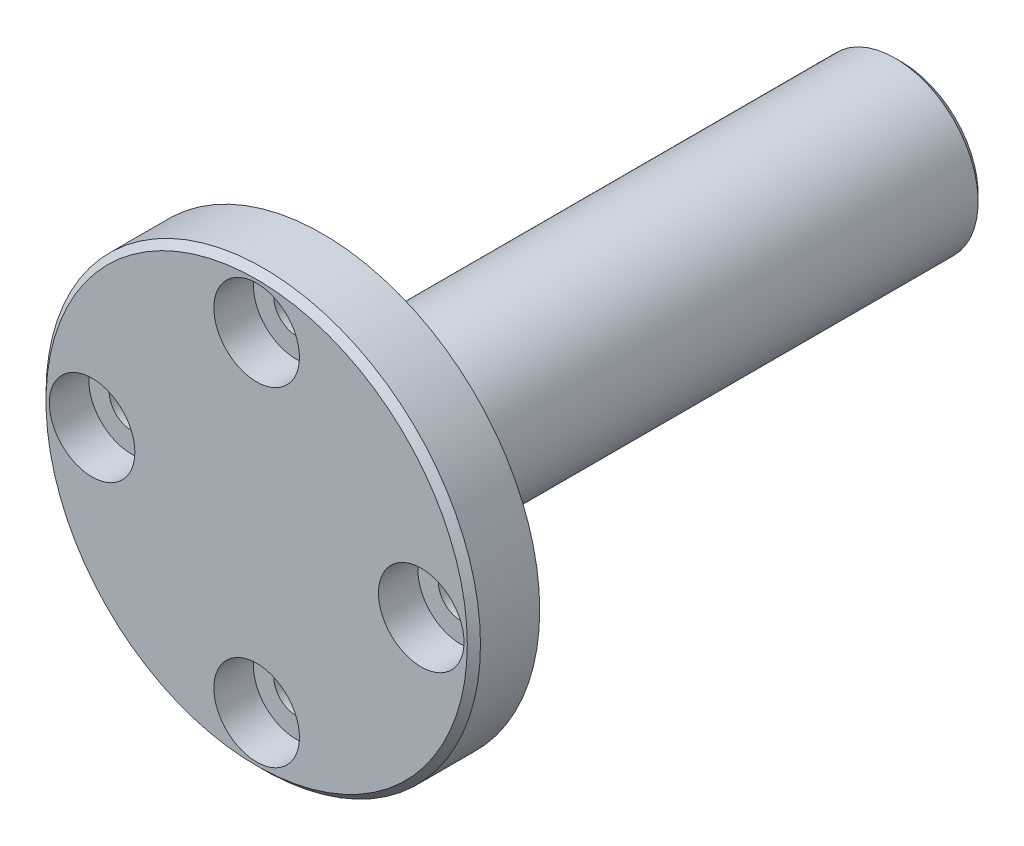
ISO-10303-21;
HEADER;
FILE_DESCRIPTION(('STEP AP214'),'2;1');
FILE_NAME('part.step','',(''),(''),'','','');
FILE_SCHEMA(('AUTOMOTIVE_DESIGN { 1 0 10303 214 1 1 1 1 }'));
ENDSEC;
DATA;
#1=APPLICATION_CONTEXT('core data for automotive mechanical design processes');
#2=APPLICATION_PROTOCOL_DEFINITION('international standard','automotive_design',2000,#1);
#3=PRODUCT_CONTEXT('',#1,'mechanical');
#4=PRODUCT('Part','Part','',(#3));
#5=PRODUCT_RELATED_PRODUCT_CATEGORY('part','',(#4));
#6=PRODUCT_DEFINITION_FORMATION('','',#4);
#7=PRODUCT_DEFINITION_CONTEXT('part definition',#1,'design');
#8=PRODUCT_DEFINITION('design','',#6,#7);
#9=PRODUCT_DEFINITION_SHAPE('','',#8);
#10=(LENGTH_UNIT() NAMED_UNIT(*) SI_UNIT(.MILLI.,.METRE.));
#11=(NAMED_UNIT(*) PLANE_ANGLE_UNIT() SI_UNIT($,.RADIAN.));
#12=(NAMED_UNIT(*) SI_UNIT($,.STERADIAN.) SOLID_ANGLE_UNIT());
#13=UNCERTAINTY_MEASURE_WITH_UNIT(LENGTH_MEASURE(1.E-05),#10,'distance_accuracy_value','');
#14=(GEOMETRIC_REPRESENTATION_CONTEXT(3) GLOBAL_UNCERTAINTY_ASSIGNED_CONTEXT((#13)) GLOBAL_UNIT_ASSIGNED_CONTEXT((#10,
#11,#12)) REPRESENTATION_CONTEXT('',''));
#15=CARTESIAN_POINT('',(0.,0.,0.));
#16=DIRECTION('',(0.,0.,1.));
#17=DIRECTION('',(1.,0.,0.));
#18=AXIS2_PLACEMENT_3D('',#15,#16,#17);
#19=CARTESIAN_POINT('',(0.,0.,0.));
#20=DIRECTION('',(0.,0.,1.));
#21=DIRECTION('',(1.,0.,0.));
#22=AXIS2_PLACEMENT_3D('',#19,#20,#21);
#23=PLANE('',#22);
#24=CARTESIAN_POINT('',(0.,0.,0.));
#25=DIRECTION('',(0.,0.,1.));
#26=DIRECTION('',(1.,0.,0.));
#27=AXIS2_PLACEMENT_3D('',#24,#25,#26);
#28=CIRCLE('',#27,16.);
#29=CARTESIAN_POINT('',(16.,0.,0.));
#30=VERTEX_POINT('',#29);
#31=EDGE_CURVE('E13',#30,#30,#28,.T.);
#32=ORIENTED_EDGE('',*,*,#31,.T.);
#33=EDGE_LOOP('',(#32));
#34=FACE_BOUND('',#33,.T.);
#35=CARTESIAN_POINT('',(-12.4999999999996,-3.52209826717166E-13,0.));
#36=DIRECTION('',(0.,0.,1.));
#37=DIRECTION('',(1.,0.,0.));
#38=AXIS2_PLACEMENT_3D('',#35,#36,#37);
#39=CIRCLE('',#38,3.25);
#40=CARTESIAN_POINT('',(-9.24999999999965,-3.52209826717166E-13,0.));
#41=VERTEX_POINT('',#40);
#42=EDGE_CURVE('E72',#41,#41,#39,.T.);
#43=ORIENTED_EDGE('',*,*,#42,.F.);
#44=EDGE_LOOP('',(#43));
#45=FACE_BOUND('',#44,.T.);
#46=CARTESIAN_POINT('',(0.,12.5,0.));
#47=DIRECTION('',(0.,0.,1.));
#48=DIRECTION('',(1.,0.,0.));
#49=AXIS2_PLACEMENT_3D('',#46,#47,#48);
#50=CIRCLE('',#49,3.25);
#51=CARTESIAN_POINT('',(3.25,12.5,0.));
#52=VERTEX_POINT('',#51);
#53=EDGE_CURVE('E87',#52,#52,#50,.T.);
#54=ORIENTED_EDGE('',*,*,#53,.F.);
#55=EDGE_LOOP('',(#54));
#56=FACE_BOUND('',#55,.T.);
#57=CARTESIAN_POINT('',(12.5000000000004,3.537406352161E-13,0.));
#58=DIRECTION('',(0.,0.,1.));
#59=DIRECTION('',(1.,0.,0.));
#60=AXIS2_PLACEMENT_3D('',#57,#58,#59);
#61=CIRCLE('',#60,3.25);
#62=CARTESIAN_POINT('',(15.7500000000004,3.537406352161E-13,0.));
#63=VERTEX_POINT('',#62);
#64=EDGE_CURVE('E97',#63,#63,#61,.T.);
#65=ORIENTED_EDGE('',*,*,#64,.F.);
#66=EDGE_LOOP('',(#65));
#67=FACE_BOUND('',#66,.T.);
#68=CARTESIAN_POINT('',(7.074812704322E-13,-12.5,0.));
#69=DIRECTION('',(0.,0.,1.));
#70=DIRECTION('',(1.,0.,0.));
#71=AXIS2_PLACEMENT_3D('',#68,#69,#70);
#72=CIRCLE('',#71,3.25);
#73=CARTESIAN_POINT('',(3.25000000000071,-12.5,0.));
#74=VERTEX_POINT('',#73);
#75=EDGE_CURVE('E107',#74,#74,#72,.T.);
#76=ORIENTED_EDGE('',*,*,#75,.F.);
#77=EDGE_LOOP('',(#76));
#78=FACE_BOUND('',#77,.T.);
#79=ADVANCED_FACE('F52',(#34,#45,#56,#67,#78),#23,.T.);
#80=CARTESIAN_POINT('',(0.,0.,-49.));
#81=DIRECTION('',(0.,0.,-1.));
#82=DIRECTION('',(-1.,0.,0.));
#83=AXIS2_PLACEMENT_3D('',#80,#81,#82);
#84=CYLINDRICAL_SURFACE('',#83,16.5);
#85=CARTESIAN_POINT('',(0.,0.,-0.500000000000007));
#86=DIRECTION('',(0.,0.,1.));
#87=DIRECTION('',(1.,0.,0.));
#88=AXIS2_PLACEMENT_3D('',#85,#86,#87);
#89=CIRCLE('',#88,16.5);
#90=CARTESIAN_POINT('',(16.5,0.,-0.500000000000007));
#91=VERTEX_POINT('',#90);
#92=EDGE_CURVE('E59',#91,#91,#89,.F.);
#93=ORIENTED_EDGE('',*,*,#92,.T.);
#94=EDGE_LOOP('',(#93));
#95=FACE_BOUND('',#94,.T.);
#96=CARTESIAN_POINT('',(0.,0.,-5.));
#97=DIRECTION('',(0.,0.,-1.));
#98=DIRECTION('',(-1.,0.,0.));
#99=AXIS2_PLACEMENT_3D('',#96,#97,#98);
#100=CIRCLE('',#99,16.5);
#101=CARTESIAN_POINT('',(-16.5,0.,-5.));
#102=VERTEX_POINT('',#101);
#103=EDGE_CURVE('E120',#102,#102,#100,.T.);
#104=ORIENTED_EDGE('',*,*,#103,.F.);
#105=EDGE_LOOP('',(#104));
#106=FACE_BOUND('',#105,.T.);
#107=ADVANCED_FACE('F139',(#95,#106),#84,.T.);
#108=CARTESIAN_POINT('',(0.,16.5,-5.));
#109=DIRECTION('',(0.,0.,-1.));
#110=DIRECTION('',(-1.,0.,0.));
#111=AXIS2_PLACEMENT_3D('',#108,#109,#110);
#112=PLANE('',#111);
#113=CARTESIAN_POINT('',(-12.4999999999996,-3.52209826717166E-13,-5.));
#114=DIRECTION('',(0.,0.,-1.));
#115=DIRECTION('',(-1.,0.,0.));
#116=AXIS2_PLACEMENT_3D('',#113,#114,#115);
#117=CIRCLE('',#116,1.69999999999999);
#118=CARTESIAN_POINT('',(-14.1999999999996,-3.52209826717166E-13,-5.));
#119=VERTEX_POINT('',#118);
#120=EDGE_CURVE('E86',#119,#119,#117,.T.);
#121=ORIENTED_EDGE('',*,*,#120,.F.);
#122=EDGE_LOOP('',(#121));
#123=FACE_BOUND('',#122,.T.);
#124=CARTESIAN_POINT('',(0.,12.5,-5.));
#125=DIRECTION('',(0.,0.,-1.));
#126=DIRECTION('',(-1.,0.,0.));
#127=AXIS2_PLACEMENT_3D('',#124,#125,#126);
#128=CIRCLE('',#127,1.69999999999999);
#129=CARTESIAN_POINT('',(-1.69999999999999,12.5,-5.));
#130=VERTEX_POINT('',#129);
#131=EDGE_CURVE('E96',#130,#130,#128,.T.);
#132=ORIENTED_EDGE('',*,*,#131,.F.);
#133=EDGE_LOOP('',(#132));
#134=FACE_BOUND('',#133,.T.);
#135=CARTESIAN_POINT('',(12.5000000000004,3.537406352161E-13,-5.));
#136=DIRECTION('',(0.,0.,-1.));
#137=DIRECTION('',(-1.,0.,0.));
#138=AXIS2_PLACEMENT_3D('',#135,#136,#137);
#139=CIRCLE('',#138,1.69999999999999);
#140=CARTESIAN_POINT('',(10.8000000000004,3.537406352161E-13,-5.));
#141=VERTEX_POINT('',#140);
#142=EDGE_CURVE('E106',#141,#141,#139,.T.);
#143=ORIENTED_EDGE('',*,*,#142,.F.);
#144=EDGE_LOOP('',(#143));
#145=FACE_BOUND('',#144,.T.);
#146=CARTESIAN_POINT('',(7.074812704322E-13,-12.5,-5.));
#147=DIRECTION('',(0.,0.,-1.));
#148=DIRECTION('',(-1.,0.,0.));
#149=AXIS2_PLACEMENT_3D('',#146,#147,#148);
#150=CIRCLE('',#149,1.69999999999999);
#151=CARTESIAN_POINT('',(-1.69999999999929,-12.5,-5.));
#152=VERTEX_POINT('',#151);
#153=EDGE_CURVE('E116',#152,#152,#150,.T.);
#154=ORIENTED_EDGE('',*,*,#153,.F.);
#155=EDGE_LOOP('',(#154));
#156=FACE_BOUND('',#155,.T.);
#157=ORIENTED_EDGE('',*,*,#103,.T.);
#158=EDGE_LOOP('',(#157));
#159=FACE_BOUND('',#158,.T.);
#160=CARTESIAN_POINT('',(0.,0.,-5.));
#161=DIRECTION('',(0.,0.,-1.));
#162=DIRECTION('',(-1.,0.,0.));
#163=AXIS2_PLACEMENT_3D('',#160,#161,#162);
#164=CIRCLE('',#163,6.3);
#165=CARTESIAN_POINT('',(-6.3,0.,-5.));
#166=VERTEX_POINT('',#165);
#167=EDGE_CURVE('E117',#166,#166,#164,.T.);
#168=ORIENTED_EDGE('',*,*,#167,.F.);
#169=EDGE_LOOP('',(#168));
#170=FACE_BOUND('',#169,.T.);
#171=ADVANCED_FACE('F156',(#123,#134,#145,#156,#159,#170),#112,.T.);
#172=CARTESIAN_POINT('',(0.,0.,-49.));
#173=DIRECTION('',(0.,0.,-1.));
#174=DIRECTION('',(-1.,0.,0.));
#175=AXIS2_PLACEMENT_3D('',#172,#173,#174);
#176=CYLINDRICAL_SURFACE('',#175,6.3);
#177=CARTESIAN_POINT('',(0.,0.,-48.5));
#178=DIRECTION('',(0.,0.,-1.));
#179=DIRECTION('',(-1.,0.,0.));
#180=AXIS2_PLACEMENT_3D('',#177,#178,#179);
#181=CIRCLE('',#180,6.3);
#182=CARTESIAN_POINT('',(-6.3,0.,-48.5));
#183=VERTEX_POINT('',#182);
#184=EDGE_CURVE('E134',#183,#183,#181,.F.);
#185=ORIENTED_EDGE('',*,*,#184,.T.);
#186=EDGE_LOOP('',(#185));
#187=FACE_BOUND('',#186,.T.);
#188=ORIENTED_EDGE('',*,*,#167,.T.);
#189=EDGE_LOOP('',(#188));
#190=FACE_BOUND('',#189,.T.);
#191=ADVANCED_FACE('F162',(#187,#190),#176,.T.);
#192=CARTESIAN_POINT('',(0.,6.3,-49.));
#193=DIRECTION('',(0.,0.,-1.));
#194=DIRECTION('',(-1.,0.,0.));
#195=AXIS2_PLACEMENT_3D('',#192,#193,#194);
#196=PLANE('',#195);
#197=CARTESIAN_POINT('',(0.,0.,-49.));
#198=DIRECTION('',(0.,0.,-1.));
#199=DIRECTION('',(-1.,0.,0.));
#200=AXIS2_PLACEMENT_3D('',#197,#198,#199);
#201=CIRCLE('',#200,5.79999999999999);
#202=CARTESIAN_POINT('',(-5.79999999999999,0.,-49.));
#203=VERTEX_POINT('',#202);
#204=EDGE_CURVE('E123',#203,#203,#201,.T.);
#205=ORIENTED_EDGE('',*,*,#204,.T.);
#206=EDGE_LOOP('',(#205));
#207=FACE_BOUND('',#206,.T.);
#208=CARTESIAN_POINT('',(0.,0.,-49.));
#209=DIRECTION('',(0.,0.,-1.));
#210=DIRECTION('',(-1.,0.,0.));
#211=AXIS2_PLACEMENT_3D('',#208,#209,#210);
#212=CIRCLE('',#211,1.25);
#213=CARTESIAN_POINT('',(-1.25,0.,-49.));
#214=VERTEX_POINT('',#213);
#215=EDGE_CURVE('E73',#214,#214,#212,.T.);
#216=ORIENTED_EDGE('',*,*,#215,.F.);
#217=EDGE_LOOP('',(#216));
#218=FACE_BOUND('',#217,.T.);
#219=ADVANCED_FACE('F166',(#207,#218),#196,.T.);
#220=CARTESIAN_POINT('',(7.074812704322E-13,-12.5,0.));
#221=DIRECTION('',(0.,0.,1.));
#222=DIRECTION('',(1.,0.,0.));
#223=AXIS2_PLACEMENT_3D('',#220,#221,#222);
#224=CYLINDRICAL_SURFACE('',#223,1.69999999999999);
#225=ORIENTED_EDGE('',*,*,#153,.T.);
#226=EDGE_LOOP('',(#225));
#227=FACE_BOUND('',#226,.T.);
#228=CARTESIAN_POINT('',(7.074812704322E-13,-12.5,-3.));
#229=DIRECTION('',(0.,0.,1.));
#230=DIRECTION('',(1.,0.,0.));
#231=AXIS2_PLACEMENT_3D('',#228,#229,#230);
#232=CIRCLE('',#231,1.7);
#233=CARTESIAN_POINT('',(1.70000000000071,-12.5,-3.));
#234=VERTEX_POINT('',#233);
#235=EDGE_CURVE('E113',#234,#234,#232,.T.);
#236=ORIENTED_EDGE('',*,*,#235,.T.);
#237=EDGE_LOOP('',(#236));
#238=FACE_BOUND('',#237,.T.);
#239=ADVANCED_FACE('F170',(#227,#238),#224,.F.);
#240=CARTESIAN_POINT('',(1.70000000000071,-12.5,-3.));
#241=DIRECTION('',(0.,0.,-1.));
#242=DIRECTION('',(-1.,0.,0.));
#243=AXIS2_PLACEMENT_3D('',#240,#241,#242);
#244=PLANE('',#243);
#245=ORIENTED_EDGE('',*,*,#235,.F.);
#246=EDGE_LOOP('',(#245));
#247=FACE_BOUND('',#246,.T.);
#248=CARTESIAN_POINT('',(7.074812704322E-13,-12.5,-3.));
#249=DIRECTION('',(0.,0.,1.));
#250=DIRECTION('',(1.,0.,0.));
#251=AXIS2_PLACEMENT_3D('',#248,#249,#250);
#252=CIRCLE('',#251,3.25);
#253=CARTESIAN_POINT('',(3.25000000000071,-12.5,-3.));
#254=VERTEX_POINT('',#253);
#255=EDGE_CURVE('E110',#254,#254,#252,.T.);
#256=ORIENTED_EDGE('',*,*,#255,.T.);
#257=EDGE_LOOP('',(#256));
#258=FACE_BOUND('',#257,.T.);
#259=ADVANCED_FACE('F174',(#247,#258),#244,.F.);
#260=CARTESIAN_POINT('',(7.074812704322E-13,-12.5,0.));
#261=DIRECTION('',(0.,0.,1.));
#262=DIRECTION('',(1.,0.,0.));
#263=AXIS2_PLACEMENT_3D('',#260,#261,#262);
#264=CYLINDRICAL_SURFACE('',#263,3.25);
#265=ORIENTED_EDGE('',*,*,#255,.F.);
#266=EDGE_LOOP('',(#265));
#267=FACE_BOUND('',#266,.T.);
#268=ORIENTED_EDGE('',*,*,#75,.T.);
#269=EDGE_LOOP('',(#268));
#270=FACE_BOUND('',#269,.T.);
#271=ADVANCED_FACE('F178',(#267,#270),#264,.F.);
#272=CARTESIAN_POINT('',(12.5000000000004,3.537406352161E-13,0.));
#273=DIRECTION('',(0.,0.,1.));
#274=DIRECTION('',(1.,0.,0.));
#275=AXIS2_PLACEMENT_3D('',#272,#273,#274);
#276=CYLINDRICAL_SURFACE('',#275,1.69999999999999);
#277=ORIENTED_EDGE('',*,*,#142,.T.);
#278=EDGE_LOOP('',(#277));
#279=FACE_BOUND('',#278,.T.);
#280=CARTESIAN_POINT('',(12.5000000000004,3.537406352161E-13,-3.));
#281=DIRECTION('',(0.,0.,1.));
#282=DIRECTION('',(1.,0.,0.));
#283=AXIS2_PLACEMENT_3D('',#280,#281,#282);
#284=CIRCLE('',#283,1.7);
#285=CARTESIAN_POINT('',(14.2000000000004,3.537406352161E-13,-3.));
#286=VERTEX_POINT('',#285);
#287=EDGE_CURVE('E103',#286,#286,#284,.T.);
#288=ORIENTED_EDGE('',*,*,#287,.T.);
#289=EDGE_LOOP('',(#288));
#290=FACE_BOUND('',#289,.T.);
#291=ADVANCED_FACE('F182',(#279,#290),#276,.F.);
#292=CARTESIAN_POINT('',(14.2000000000004,3.537406352161E-13,-3.));
#293=DIRECTION('',(0.,0.,-1.));
#294=DIRECTION('',(-1.,0.,0.));
#295=AXIS2_PLACEMENT_3D('',#292,#293,#294);
#296=PLANE('',#295);
#297=ORIENTED_EDGE('',*,*,#287,.F.);
#298=EDGE_LOOP('',(#297));
#299=FACE_BOUND('',#298,.T.);
#300=CARTESIAN_POINT('',(12.5000000000004,3.537406352161E-13,-3.));
#301=DIRECTION('',(0.,0.,1.));
#302=DIRECTION('',(1.,0.,0.));
#303=AXIS2_PLACEMENT_3D('',#300,#301,#302);
#304=CIRCLE('',#303,3.25);
#305=CARTESIAN_POINT('',(15.7500000000004,3.537406352161E-13,-3.));
#306=VERTEX_POINT('',#305);
#307=EDGE_CURVE('E100',#306,#306,#304,.T.);
#308=ORIENTED_EDGE('',*,*,#307,.T.);
#309=EDGE_LOOP('',(#308));
#310=FACE_BOUND('',#309,.T.);
#311=ADVANCED_FACE('F186',(#299,#310),#296,.F.);
#312=CARTESIAN_POINT('',(12.5000000000004,3.537406352161E-13,0.));
#313=DIRECTION('',(0.,0.,1.));
#314=DIRECTION('',(1.,0.,0.));
#315=AXIS2_PLACEMENT_3D('',#312,#313,#314);
#316=CYLINDRICAL_SURFACE('',#315,3.25);
#317=ORIENTED_EDGE('',*,*,#307,.F.);
#318=EDGE_LOOP('',(#317));
#319=FACE_BOUND('',#318,.T.);
#320=ORIENTED_EDGE('',*,*,#64,.T.);
#321=EDGE_LOOP('',(#320));
#322=FACE_BOUND('',#321,.T.);
#323=ADVANCED_FACE('F190',(#319,#322),#316,.F.);
#324=CARTESIAN_POINT('',(0.,12.5,0.));
#325=DIRECTION('',(0.,0.,1.));
#326=DIRECTION('',(1.,0.,0.));
#327=AXIS2_PLACEMENT_3D('',#324,#325,#326);
#328=CYLINDRICAL_SURFACE('',#327,1.69999999999999);
#329=ORIENTED_EDGE('',*,*,#131,.T.);
#330=EDGE_LOOP('',(#329));
#331=FACE_BOUND('',#330,.T.);
#332=CARTESIAN_POINT('',(0.,12.5,-3.));
#333=DIRECTION('',(0.,0.,1.));
#334=DIRECTION('',(1.,0.,0.));
#335=AXIS2_PLACEMENT_3D('',#332,#333,#334);
#336=CIRCLE('',#335,1.7);
#337=CARTESIAN_POINT('',(1.7,12.5,-3.));
#338=VERTEX_POINT('',#337);
#339=EDGE_CURVE('E93',#338,#338,#336,.T.);
#340=ORIENTED_EDGE('',*,*,#339,.T.);
#341=EDGE_LOOP('',(#340));
#342=FACE_BOUND('',#341,.T.);
#343=ADVANCED_FACE('F194',(#331,#342),#328,.F.);
#344=CARTESIAN_POINT('',(1.7,12.5,-3.));
#345=DIRECTION('',(0.,0.,-1.));
#346=DIRECTION('',(-1.,0.,0.));
#347=AXIS2_PLACEMENT_3D('',#344,#345,#346);
#348=PLANE('',#347);
#349=ORIENTED_EDGE('',*,*,#339,.F.);
#350=EDGE_LOOP('',(#349));
#351=FACE_BOUND('',#350,.T.);
#352=CARTESIAN_POINT('',(0.,12.5,-3.));
#353=DIRECTION('',(0.,0.,1.));
#354=DIRECTION('',(1.,0.,0.));
#355=AXIS2_PLACEMENT_3D('',#352,#353,#354);
#356=CIRCLE('',#355,3.25);
#357=CARTESIAN_POINT('',(3.25,12.5,-3.));
#358=VERTEX_POINT('',#357);
#359=EDGE_CURVE('E90',#358,#358,#356,.T.);
#360=ORIENTED_EDGE('',*,*,#359,.T.);
#361=EDGE_LOOP('',(#360));
#362=FACE_BOUND('',#361,.T.);
#363=ADVANCED_FACE('F198',(#351,#362),#348,.F.);
#364=CARTESIAN_POINT('',(0.,12.5,0.));
#365=DIRECTION('',(0.,0.,1.));
#366=DIRECTION('',(1.,0.,0.));
#367=AXIS2_PLACEMENT_3D('',#364,#365,#366);
#368=CYLINDRICAL_SURFACE('',#367,3.25);
#369=ORIENTED_EDGE('',*,*,#359,.F.);
#370=EDGE_LOOP('',(#369));
#371=FACE_BOUND('',#370,.T.);
#372=ORIENTED_EDGE('',*,*,#53,.T.);
#373=EDGE_LOOP('',(#372));
#374=FACE_BOUND('',#373,.T.);
#375=ADVANCED_FACE('F202',(#371,#374),#368,.F.);
#376=CARTESIAN_POINT('',(-12.4999999999996,-3.52209826717166E-13,0.));
#377=DIRECTION('',(0.,0.,1.));
#378=DIRECTION('',(1.,0.,0.));
#379=AXIS2_PLACEMENT_3D('',#376,#377,#378);
#380=CYLINDRICAL_SURFACE('',#379,1.69999999999999);
#381=ORIENTED_EDGE('',*,*,#120,.T.);
#382=EDGE_LOOP('',(#381));
#383=FACE_BOUND('',#382,.T.);
#384=CARTESIAN_POINT('',(-12.4999999999996,-3.52209826717166E-13,-3.));
#385=DIRECTION('',(0.,0.,1.));
#386=DIRECTION('',(1.,0.,0.));
#387=AXIS2_PLACEMENT_3D('',#384,#385,#386);
#388=CIRCLE('',#387,1.7);
#389=CARTESIAN_POINT('',(-10.7999999999996,-3.52209826717166E-13,-3.));
#390=VERTEX_POINT('',#389);
#391=EDGE_CURVE('E83',#390,#390,#388,.T.);
#392=ORIENTED_EDGE('',*,*,#391,.T.);
#393=EDGE_LOOP('',(#392));
#394=FACE_BOUND('',#393,.T.);
#395=ADVANCED_FACE('F206',(#383,#394),#380,.F.);
#396=CARTESIAN_POINT('',(-10.7999999999996,-3.52209826717166E-13,-3.));
#397=DIRECTION('',(0.,0.,-1.));
#398=DIRECTION('',(-1.,0.,0.));
#399=AXIS2_PLACEMENT_3D('',#396,#397,#398);
#400=PLANE('',#399);
#401=ORIENTED_EDGE('',*,*,#391,.F.);
#402=EDGE_LOOP('',(#401));
#403=FACE_BOUND('',#402,.T.);
#404=CARTESIAN_POINT('',(-12.4999999999996,-3.52209826717166E-13,-3.));
#405=DIRECTION('',(0.,0.,1.));
#406=DIRECTION('',(1.,0.,0.));
#407=AXIS2_PLACEMENT_3D('',#404,#405,#406);
#408=CIRCLE('',#407,3.25);
#409=CARTESIAN_POINT('',(-9.24999999999965,-3.52209826717166E-13,-3.));
#410=VERTEX_POINT('',#409);
#411=EDGE_CURVE('E76',#410,#410,#408,.T.);
#412=ORIENTED_EDGE('',*,*,#411,.T.);
#413=EDGE_LOOP('',(#412));
#414=FACE_BOUND('',#413,.T.);
#415=ADVANCED_FACE('F210',(#403,#414),#400,.F.);
#416=CARTESIAN_POINT('',(-12.4999999999996,-3.52209826717166E-13,0.));
#417=DIRECTION('',(0.,0.,1.));
#418=DIRECTION('',(1.,0.,0.));
#419=AXIS2_PLACEMENT_3D('',#416,#417,#418);
#420=CYLINDRICAL_SURFACE('',#419,3.25);
#421=ORIENTED_EDGE('',*,*,#411,.F.);
#422=EDGE_LOOP('',(#421));
#423=FACE_BOUND('',#422,.T.);
#424=ORIENTED_EDGE('',*,*,#42,.T.);
#425=EDGE_LOOP('',(#424));
#426=FACE_BOUND('',#425,.T.);
#427=ADVANCED_FACE('F66',(#423,#426),#420,.F.);
#428=CARTESIAN_POINT('',(0.,0.,-34.));
#429=DIRECTION('',(0.,0.,-1.));
#430=DIRECTION('',(-1.,0.,0.));
#431=AXIS2_PLACEMENT_3D('',#428,#429,#430);
#432=CONICAL_SURFACE('',#431,1.25,1.02974425867665);
#433=CARTESIAN_POINT('',(0.,0.,-33.2489242262155));
#434=VERTEX_POINT('',#433);
#435=VERTEX_LOOP('',#434);
#436=FACE_BOUND('',#435,.T.);
#437=CARTESIAN_POINT('',(0.,0.,-34.));
#438=DIRECTION('',(0.,0.,-1.));
#439=DIRECTION('',(-1.,0.,0.));
#440=AXIS2_PLACEMENT_3D('',#437,#438,#439);
#441=CIRCLE('',#440,1.25);
#442=CARTESIAN_POINT('',(-1.25,0.,-34.));
#443=VERTEX_POINT('',#442);
#444=EDGE_CURVE('E70',#443,#443,#441,.T.);
#445=ORIENTED_EDGE('',*,*,#444,.T.);
#446=EDGE_LOOP('',(#445));
#447=FACE_BOUND('',#446,.T.);
#448=ADVANCED_FACE('F62',(#436,#447),#432,.F.);
#449=CARTESIAN_POINT('',(0.,0.,-49.));
#450=DIRECTION('',(0.,0.,-1.));
#451=DIRECTION('',(-1.,0.,0.));
#452=AXIS2_PLACEMENT_3D('',#449,#450,#451);
#453=CYLINDRICAL_SURFACE('',#452,1.25);
#454=ORIENTED_EDGE('',*,*,#444,.F.);
#455=EDGE_LOOP('',(#454));
#456=FACE_BOUND('',#455,.T.);
#457=ORIENTED_EDGE('',*,*,#215,.T.);
#458=EDGE_LOOP('',(#457));
#459=FACE_BOUND('',#458,.T.);
#460=ADVANCED_FACE('F65',(#456,#459),#453,.F.);
#461=CARTESIAN_POINT('',(0.,0.,-49.));
#462=DIRECTION('',(0.,0.,1.));
#463=DIRECTION('',(1.,0.,0.));
#464=AXIS2_PLACEMENT_3D('',#461,#462,#463);
#465=CONICAL_SURFACE('',#464,5.79999999999999,0.785398163397449);
#466=ORIENTED_EDGE('',*,*,#184,.F.);
#467=EDGE_LOOP('',(#466));
#468=FACE_BOUND('',#467,.T.);
#469=ORIENTED_EDGE('',*,*,#204,.F.);
#470=EDGE_LOOP('',(#469));
#471=FACE_BOUND('',#470,.T.);
#472=ADVANCED_FACE('F143',(#468,#471),#465,.T.);
#473=CARTESIAN_POINT('',(0.,0.,-0.500000000000007));
#474=DIRECTION('',(0.,0.,-1.));
#475=DIRECTION('',(-1.,0.,0.));
#476=AXIS2_PLACEMENT_3D('',#473,#474,#475);
#477=CONICAL_SURFACE('',#476,16.5,0.785398163397448);
#478=ORIENTED_EDGE('',*,*,#31,.F.);
#479=EDGE_LOOP('',(#478));
#480=FACE_BOUND('',#479,.T.);
#481=ORIENTED_EDGE('',*,*,#92,.F.);
#482=EDGE_LOOP('',(#481));
#483=FACE_BOUND('',#482,.T.);
#484=ADVANCED_FACE('F54',(#480,#483),#477,.T.);
#485=CLOSED_SHELL('',(#79,#107,#171,#191,#219,#239,#259,#271,#291,#311,#323,#343,#363,#375,#395,
#415,#427,#448,#460,#472,#484));
#486=MANIFOLD_SOLID_BREP('B2',#485);
#487=ADVANCED_BREP_SHAPE_REPRESENTATION('',(#18,#486),#14);
#488=SHAPE_DEFINITION_REPRESENTATION(#9,#487);
ENDSEC;
END-ISO-10303-21;
